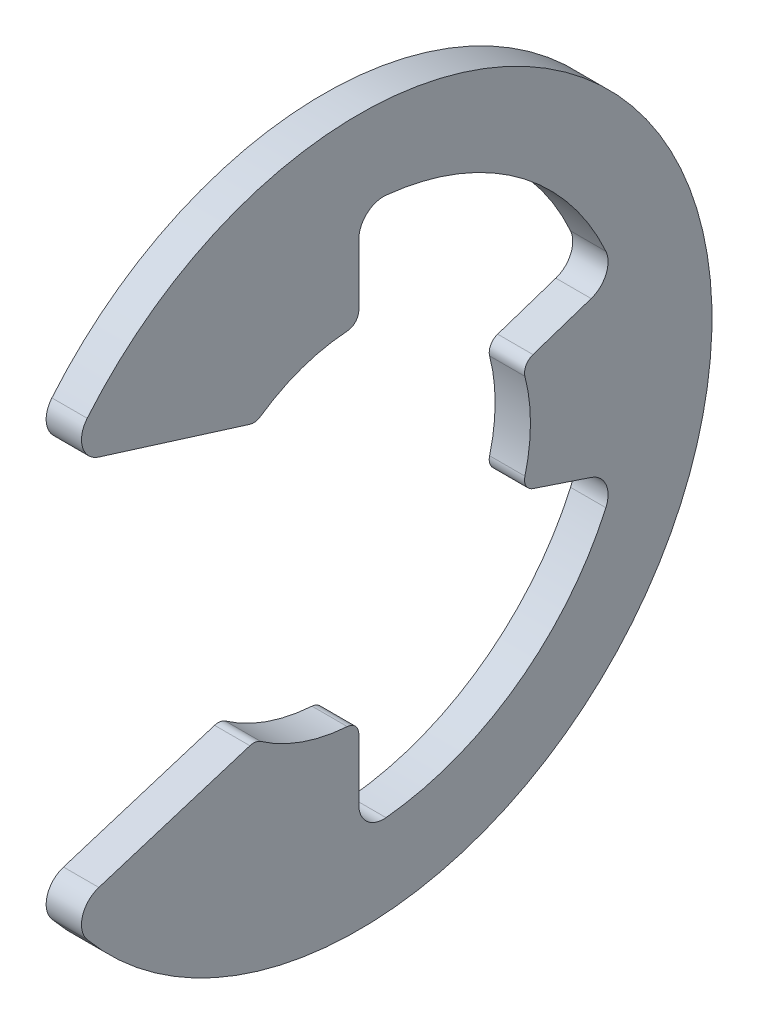
ISO-10303-21;
HEADER;
FILE_DESCRIPTION(('STEP AP214'),'2;1');
FILE_NAME('part.step','',(''),(''),'','','');
FILE_SCHEMA(('AUTOMOTIVE_DESIGN { 1 0 10303 214 1 1 1 1 }'));
ENDSEC;
DATA;
#1=APPLICATION_CONTEXT('core data for automotive mechanical design processes');
#2=APPLICATION_PROTOCOL_DEFINITION('international standard','automotive_design',2000,#1);
#3=PRODUCT_CONTEXT('',#1,'mechanical');
#4=PRODUCT('Part','Part','',(#3));
#5=PRODUCT_RELATED_PRODUCT_CATEGORY('part','',(#4));
#6=PRODUCT_DEFINITION_FORMATION('','',#4);
#7=PRODUCT_DEFINITION_CONTEXT('part definition',#1,'design');
#8=PRODUCT_DEFINITION('design','',#6,#7);
#9=PRODUCT_DEFINITION_SHAPE('','',#8);
#10=(LENGTH_UNIT() NAMED_UNIT(*) SI_UNIT(.MILLI.,.METRE.));
#11=(NAMED_UNIT(*) PLANE_ANGLE_UNIT() SI_UNIT($,.RADIAN.));
#12=(NAMED_UNIT(*) SI_UNIT($,.STERADIAN.) SOLID_ANGLE_UNIT());
#13=UNCERTAINTY_MEASURE_WITH_UNIT(LENGTH_MEASURE(1.E-05),#10,'distance_accuracy_value','');
#14=(GEOMETRIC_REPRESENTATION_CONTEXT(3) GLOBAL_UNCERTAINTY_ASSIGNED_CONTEXT((#13)) GLOBAL_UNIT_ASSIGNED_CONTEXT((#10,
#11,#12)) REPRESENTATION_CONTEXT('',''));
#15=CARTESIAN_POINT('',(0.,0.,0.));
#16=DIRECTION('',(0.,0.,1.));
#17=DIRECTION('',(1.,0.,0.));
#18=AXIS2_PLACEMENT_3D('',#15,#16,#17);
#19=CARTESIAN_POINT('',(0.3175,3.30087634727507,0.22225));
#20=DIRECTION('',(-1.,0.,0.));
#21=DIRECTION('',(0.,0.,1.));
#22=AXIS2_PLACEMENT_3D('',#19,#20,#21);
#23=CYLINDRICAL_SURFACE('',#22,0.22225);
#24=CARTESIAN_POINT('',(0.3175,3.30087634727507,0.22225));
#25=DIRECTION('',(1.,0.,0.));
#26=DIRECTION('',(0.,0.,-1.));
#27=AXIS2_PLACEMENT_3D('',#24,#25,#26);
#28=CIRCLE('',#27,0.22225);
#29=CARTESIAN_POINT('',(0.3175,3.07912841607617,0.207319577735126));
#30=VERTEX_POINT('',#29);
#31=CARTESIAN_POINT('',(0.3175,3.30087634727507,0.));
#32=VERTEX_POINT('',#31);
#33=EDGE_CURVE('E191',#30,#32,#28,.T.);
#34=ORIENTED_EDGE('',*,*,#33,.F.);
#35=DIRECTION('',(1.,0.,0.));
#36=VECTOR('',#35,1.);
#37=CARTESIAN_POINT('',(0.3175,3.07912841607617,0.207319577735126));
#38=LINE('',#37,#36);
#39=CARTESIAN_POINT('',(-0.3175,3.07912841607617,0.207319577735126));
#40=VERTEX_POINT('',#39);
#41=EDGE_CURVE('E277',#40,#30,#38,.T.);
#42=ORIENTED_EDGE('',*,*,#41,.F.);
#43=CARTESIAN_POINT('',(-0.3175,3.30087634727507,0.22225));
#44=DIRECTION('',(-1.,0.,0.));
#45=DIRECTION('',(0.,0.,-1.));
#46=AXIS2_PLACEMENT_3D('',#43,#44,#45);
#47=CIRCLE('',#46,0.22225);
#48=CARTESIAN_POINT('',(-0.3175,3.30087634727507,0.));
#49=VERTEX_POINT('',#48);
#50=EDGE_CURVE('E219',#49,#40,#47,.T.);
#51=ORIENTED_EDGE('',*,*,#50,.F.);
#52=DIRECTION('',(-1.,0.,0.));
#53=VECTOR('',#52,1.);
#54=CARTESIAN_POINT('',(0.3175,3.30087634727507,0.));
#55=LINE('',#54,#53);
#56=EDGE_CURVE('E284',#32,#49,#55,.T.);
#57=ORIENTED_EDGE('',*,*,#56,.F.);
#58=EDGE_LOOP('',(#34,#42,#51,#57));
#59=FACE_BOUND('',#58,.T.);
#60=ADVANCED_FACE('F16',(#59),#23,.T.);
#61=CARTESIAN_POINT('',(0.3175,2.71420663972902,1.8916294667167));
#62=DIRECTION('',(-1.,0.,0.));
#63=DIRECTION('',(0.,0.,1.));
#64=AXIS2_PLACEMENT_3D('',#61,#62,#63);
#65=CYLINDRICAL_SURFACE('',#64,0.22225);
#66=CARTESIAN_POINT('',(0.3175,2.71420663972902,1.8916294667167));
#67=DIRECTION('',(1.,0.,0.));
#68=DIRECTION('',(0.,0.,-1.));
#69=AXIS2_PLACEMENT_3D('',#66,#67,#68);
#70=CIRCLE('',#69,0.22225);
#71=CARTESIAN_POINT('',(0.3175,2.50206600572264,1.957897210781));
#72=VERTEX_POINT('',#71);
#73=CARTESIAN_POINT('',(0.3175,2.53187030116757,1.76455263114072));
#74=VERTEX_POINT('',#73);
#75=EDGE_CURVE('E205',#72,#74,#70,.T.);
#76=ORIENTED_EDGE('',*,*,#75,.F.);
#77=DIRECTION('',(1.,0.,0.));
#78=VECTOR('',#77,1.);
#79=CARTESIAN_POINT('',(0.3175,2.50206600572264,1.957897210781));
#80=LINE('',#79,#78);
#81=CARTESIAN_POINT('',(-0.3175,2.50206600572264,1.957897210781));
#82=VERTEX_POINT('',#81);
#83=EDGE_CURVE('E260',#82,#72,#80,.T.);
#84=ORIENTED_EDGE('',*,*,#83,.F.);
#85=CARTESIAN_POINT('',(-0.3175,2.71420663972902,1.8916294667167));
#86=DIRECTION('',(-1.,0.,0.));
#87=DIRECTION('',(0.,0.,-1.));
#88=AXIS2_PLACEMENT_3D('',#85,#86,#87);
#89=CIRCLE('',#88,0.22225);
#90=CARTESIAN_POINT('',(-0.3175,2.53187030116757,1.76455263114072));
#91=VERTEX_POINT('',#90);
#92=EDGE_CURVE('E25',#91,#82,#89,.T.);
#93=ORIENTED_EDGE('',*,*,#92,.F.);
#94=DIRECTION('',(-1.,0.,0.));
#95=VECTOR('',#94,1.);
#96=CARTESIAN_POINT('',(0.3175,2.53187030116757,1.76455263114072));
#97=LINE('',#96,#95);
#98=EDGE_CURVE('E270',#74,#91,#97,.T.);
#99=ORIENTED_EDGE('',*,*,#98,.F.);
#100=EDGE_LOOP('',(#76,#84,#93,#99));
#101=FACE_BOUND('',#100,.T.);
#102=ADVANCED_FACE('F1089',(#101),#65,.T.);
#103=CARTESIAN_POINT('',(0.3175,-2.71420663972902,1.8916294667167));
#104=DIRECTION('',(-1.,0.,0.));
#105=DIRECTION('',(0.,0.,1.));
#106=AXIS2_PLACEMENT_3D('',#103,#104,#105);
#107=CYLINDRICAL_SURFACE('',#106,0.22225);
#108=CARTESIAN_POINT('',(0.3175,-2.71420663972902,1.8916294667167));
#109=DIRECTION('',(1.,0.,0.));
#110=DIRECTION('',(0.,0.,-1.));
#111=AXIS2_PLACEMENT_3D('',#108,#109,#110);
#112=CIRCLE('',#111,0.22225);
#113=CARTESIAN_POINT('',(0.3175,-2.53187030116757,1.76455263114072));
#114=VERTEX_POINT('',#113);
#115=CARTESIAN_POINT('',(0.3175,-2.50206600572264,1.957897210781));
#116=VERTEX_POINT('',#115);
#117=EDGE_CURVE('E200',#114,#116,#112,.T.);
#118=ORIENTED_EDGE('',*,*,#117,.F.);
#119=DIRECTION('',(1.,0.,0.));
#120=VECTOR('',#119,1.);
#121=CARTESIAN_POINT('',(0.3175,-2.53187030116757,1.76455263114072));
#122=LINE('',#121,#120);
#123=CARTESIAN_POINT('',(-0.3175,-2.53187030116757,1.76455263114072));
#124=VERTEX_POINT('',#123);
#125=EDGE_CURVE('E438',#124,#114,#122,.T.);
#126=ORIENTED_EDGE('',*,*,#125,.F.);
#127=CARTESIAN_POINT('',(-0.3175,-2.71420663972902,1.8916294667167));
#128=DIRECTION('',(-1.,0.,0.));
#129=DIRECTION('',(0.,0.,-1.));
#130=AXIS2_PLACEMENT_3D('',#127,#128,#129);
#131=CIRCLE('',#130,0.22225);
#132=CARTESIAN_POINT('',(-0.3175,-2.50206600572264,1.957897210781));
#133=VERTEX_POINT('',#132);
#134=EDGE_CURVE('E11',#133,#124,#131,.T.);
#135=ORIENTED_EDGE('',*,*,#134,.F.);
#136=DIRECTION('',(-1.,0.,0.));
#137=VECTOR('',#136,1.);
#138=CARTESIAN_POINT('',(0.3175,-2.50206600572264,1.957897210781));
#139=LINE('',#138,#137);
#140=EDGE_CURVE('E447',#116,#133,#139,.T.);
#141=ORIENTED_EDGE('',*,*,#140,.F.);
#142=EDGE_LOOP('',(#118,#126,#135,#141));
#143=FACE_BOUND('',#142,.T.);
#144=ADVANCED_FACE('F1097',(#143),#107,.T.);
#145=CARTESIAN_POINT('',(0.3175,-3.30087634727507,0.22225));
#146=DIRECTION('',(-1.,0.,0.));
#147=DIRECTION('',(0.,0.,1.));
#148=AXIS2_PLACEMENT_3D('',#145,#146,#147);
#149=CYLINDRICAL_SURFACE('',#148,0.22225);
#150=CARTESIAN_POINT('',(0.3175,-3.30087634727507,0.22225));
#151=DIRECTION('',(1.,0.,0.));
#152=DIRECTION('',(0.,0.,-1.));
#153=AXIS2_PLACEMENT_3D('',#150,#151,#152);
#154=CIRCLE('',#153,0.22225);
#155=CARTESIAN_POINT('',(0.3175,-3.30087634727507,0.));
#156=VERTEX_POINT('',#155);
#157=CARTESIAN_POINT('',(0.3175,-3.07912841607617,0.207319577735124));
#158=VERTEX_POINT('',#157);
#159=EDGE_CURVE('E198',#156,#158,#154,.T.);
#160=ORIENTED_EDGE('',*,*,#159,.F.);
#161=DIRECTION('',(1.,0.,0.));
#162=VECTOR('',#161,1.);
#163=CARTESIAN_POINT('',(0.3175,-3.30087634727507,0.));
#164=LINE('',#163,#162);
#165=CARTESIAN_POINT('',(-0.3175,-3.30087634727507,0.));
#166=VERTEX_POINT('',#165);
#167=EDGE_CURVE('E400',#166,#156,#164,.T.);
#168=ORIENTED_EDGE('',*,*,#167,.F.);
#169=CARTESIAN_POINT('',(-0.3175,-3.30087634727507,0.22225));
#170=DIRECTION('',(-1.,0.,0.));
#171=DIRECTION('',(0.,0.,-1.));
#172=AXIS2_PLACEMENT_3D('',#169,#170,#171);
#173=CIRCLE('',#172,0.22225);
#174=CARTESIAN_POINT('',(-0.3175,-3.07912841607617,0.207319577735124));
#175=VERTEX_POINT('',#174);
#176=EDGE_CURVE('E210',#175,#166,#173,.T.);
#177=ORIENTED_EDGE('',*,*,#176,.F.);
#178=DIRECTION('',(-1.,0.,0.));
#179=VECTOR('',#178,1.);
#180=CARTESIAN_POINT('',(0.3175,-3.07912841607617,0.207319577735125));
#181=LINE('',#180,#179);
#182=EDGE_CURVE('E398',#158,#175,#181,.T.);
#183=ORIENTED_EDGE('',*,*,#182,.F.);
#184=EDGE_LOOP('',(#160,#168,#177,#183));
#185=FACE_BOUND('',#184,.T.);
#186=ADVANCED_FACE('F395',(#185),#149,.T.);
#187=CARTESIAN_POINT('',(0.3175,4.40336689167331,-0.4445));
#188=DIRECTION('',(-1.,0.,0.));
#189=DIRECTION('',(0.,0.,1.));
#190=AXIS2_PLACEMENT_3D('',#187,#188,#189);
#191=CYLINDRICAL_SURFACE('',#190,0.4445);
#192=CARTESIAN_POINT('',(0.3175,4.40336689167331,-0.4445));
#193=DIRECTION('',(-1.,0.,0.));
#194=DIRECTION('',(0.,0.,-1.));
#195=AXIS2_PLACEMENT_3D('',#192,#193,#194);
#196=CIRCLE('',#195,0.4445);
#197=CARTESIAN_POINT('',(0.3175,4.40336689167331,0.));
#198=VERTEX_POINT('',#197);
#199=CARTESIAN_POINT('',(0.3175,4.84561932872465,-0.489143386096454));
#200=VERTEX_POINT('',#199);
#201=EDGE_CURVE('E195',#198,#200,#196,.T.);
#202=ORIENTED_EDGE('',*,*,#201,.F.);
#203=DIRECTION('',(1.,0.,0.));
#204=VECTOR('',#203,1.);
#205=CARTESIAN_POINT('',(0.3175,4.40336689167331,0.));
#206=LINE('',#205,#204);
#207=CARTESIAN_POINT('',(-0.3175,4.40336689167331,0.));
#208=VERTEX_POINT('',#207);
#209=EDGE_CURVE('E185',#208,#198,#206,.T.);
#210=ORIENTED_EDGE('',*,*,#209,.F.);
#211=CARTESIAN_POINT('',(-0.3175,4.40336689167331,-0.4445));
#212=DIRECTION('',(1.,0.,0.));
#213=DIRECTION('',(0.,0.,-1.));
#214=AXIS2_PLACEMENT_3D('',#211,#212,#213);
#215=CIRCLE('',#214,0.4445);
#216=CARTESIAN_POINT('',(-0.3175,4.84561932872465,-0.489143386096454));
#217=VERTEX_POINT('',#216);
#218=EDGE_CURVE('E220',#217,#208,#215,.T.);
#219=ORIENTED_EDGE('',*,*,#218,.F.);
#220=DIRECTION('',(-1.,0.,0.));
#221=VECTOR('',#220,1.);
#222=CARTESIAN_POINT('',(0.3175,4.84561932872465,-0.489143386096454));
#223=LINE('',#222,#221);
#224=EDGE_CURVE('E162',#200,#217,#223,.T.);
#225=ORIENTED_EDGE('',*,*,#224,.F.);
#226=EDGE_LOOP('',(#202,#210,#219,#225));
#227=FACE_BOUND('',#226,.T.);
#228=ADVANCED_FACE('F297',(#227),#191,.F.);
#229=CARTESIAN_POINT('',(0.3175,1.81415660108981,-4.03683738332459));
#230=DIRECTION('',(-1.,0.,0.));
#231=DIRECTION('',(0.,0.,1.));
#232=AXIS2_PLACEMENT_3D('',#229,#230,#231);
#233=CYLINDRICAL_SURFACE('',#232,0.4445);
#234=CARTESIAN_POINT('',(0.3175,1.81415660108981,-4.03683738332459));
#235=DIRECTION('',(-1.,0.,0.));
#236=DIRECTION('',(0.,0.,-1.));
#237=AXIS2_PLACEMENT_3D('',#234,#235,#236);
#238=CIRCLE('',#237,0.4445);
#239=CARTESIAN_POINT('',(0.3175,1.99636153603219,-4.44227740562462));
#240=VERTEX_POINT('',#239);
#241=CARTESIAN_POINT('',(0.3175,1.39246687510636,-4.17740062531908));
#242=VERTEX_POINT('',#241);
#243=EDGE_CURVE('E36',#240,#242,#238,.T.);
#244=ORIENTED_EDGE('',*,*,#243,.F.);
#245=DIRECTION('',(1.,0.,0.));
#246=VECTOR('',#245,1.);
#247=CARTESIAN_POINT('',(0.3175,1.99636153603219,-4.44227740562462));
#248=LINE('',#247,#246);
#249=CARTESIAN_POINT('',(-0.3175,1.99636153603219,-4.44227740562462));
#250=VERTEX_POINT('',#249);
#251=EDGE_CURVE('E178',#250,#240,#248,.T.);
#252=ORIENTED_EDGE('',*,*,#251,.F.);
#253=CARTESIAN_POINT('',(-0.3175,1.81415660108981,-4.03683738332459));
#254=DIRECTION('',(1.,0.,0.));
#255=DIRECTION('',(0.,0.,-1.));
#256=AXIS2_PLACEMENT_3D('',#253,#254,#255);
#257=CIRCLE('',#256,0.4445);
#258=CARTESIAN_POINT('',(-0.3175,1.39246687510636,-4.17740062531908));
#259=VERTEX_POINT('',#258);
#260=EDGE_CURVE('E216',#259,#250,#257,.T.);
#261=ORIENTED_EDGE('',*,*,#260,.F.);
#262=DIRECTION('',(-1.,0.,0.));
#263=VECTOR('',#262,1.);
#264=CARTESIAN_POINT('',(-0.3175,1.39246687510636,-4.17740062531908));
#265=LINE('',#264,#263);
#266=EDGE_CURVE('E161',#242,#259,#265,.T.);
#267=ORIENTED_EDGE('',*,*,#266,.F.);
#268=EDGE_LOOP('',(#244,#252,#261,#267));
#269=FACE_BOUND('',#268,.T.);
#270=ADVANCED_FACE('F291',(#269),#233,.F.);
#271=CARTESIAN_POINT('',(0.3175,-1.81415660108981,-4.03683738332459));
#272=DIRECTION('',(-1.,0.,0.));
#273=DIRECTION('',(0.,0.,1.));
#274=AXIS2_PLACEMENT_3D('',#271,#272,#273);
#275=CYLINDRICAL_SURFACE('',#274,0.4445);
#276=CARTESIAN_POINT('',(0.3175,-1.81415660108981,-4.03683738332459));
#277=DIRECTION('',(-1.,0.,0.));
#278=DIRECTION('',(0.,0.,-1.));
#279=AXIS2_PLACEMENT_3D('',#276,#277,#278);
#280=CIRCLE('',#279,0.4445);
#281=CARTESIAN_POINT('',(0.3175,-1.39246687510636,-4.17740062531908));
#282=VERTEX_POINT('',#281);
#283=CARTESIAN_POINT('',(0.3175,-1.99636153603219,-4.44227740562462));
#284=VERTEX_POINT('',#283);
#285=EDGE_CURVE('E181',#282,#284,#280,.T.);
#286=ORIENTED_EDGE('',*,*,#285,.F.);
#287=DIRECTION('',(1.,0.,0.));
#288=VECTOR('',#287,1.);
#289=CARTESIAN_POINT('',(0.3175,-1.39246687510636,-4.17740062531908));
#290=LINE('',#289,#288);
#291=CARTESIAN_POINT('',(-0.3175,-1.39246687510636,-4.17740062531908));
#292=VERTEX_POINT('',#291);
#293=EDGE_CURVE('E703',#292,#282,#290,.T.);
#294=ORIENTED_EDGE('',*,*,#293,.F.);
#295=CARTESIAN_POINT('',(-0.3175,-1.81415660108981,-4.03683738332459));
#296=DIRECTION('',(1.,0.,0.));
#297=DIRECTION('',(0.,0.,-1.));
#298=AXIS2_PLACEMENT_3D('',#295,#296,#297);
#299=CIRCLE('',#298,0.4445);
#300=CARTESIAN_POINT('',(-0.3175,-1.99636153603219,-4.44227740562462));
#301=VERTEX_POINT('',#300);
#302=EDGE_CURVE('E215',#301,#292,#299,.T.);
#303=ORIENTED_EDGE('',*,*,#302,.F.);
#304=DIRECTION('',(-1.,0.,0.));
#305=VECTOR('',#304,1.);
#306=CARTESIAN_POINT('',(0.3175,-1.99636153603219,-4.44227740562462));
#307=LINE('',#306,#305);
#308=EDGE_CURVE('E419',#284,#301,#307,.T.);
#309=ORIENTED_EDGE('',*,*,#308,.F.);
#310=EDGE_LOOP('',(#286,#294,#303,#309));
#311=FACE_BOUND('',#310,.T.);
#312=ADVANCED_FACE('F1118',(#311),#275,.F.);
#313=CARTESIAN_POINT('',(0.3175,-4.40336689167331,-0.4445));
#314=DIRECTION('',(-1.,0.,0.));
#315=DIRECTION('',(0.,0.,1.));
#316=AXIS2_PLACEMENT_3D('',#313,#314,#315);
#317=CYLINDRICAL_SURFACE('',#316,0.4445);
#318=CARTESIAN_POINT('',(0.3175,-4.40336689167331,-0.4445));
#319=DIRECTION('',(-1.,0.,0.));
#320=DIRECTION('',(0.,0.,-1.));
#321=AXIS2_PLACEMENT_3D('',#318,#319,#320);
#322=CIRCLE('',#321,0.4445);
#323=CARTESIAN_POINT('',(0.3175,-4.84561932872465,-0.489143386096454));
#324=VERTEX_POINT('',#323);
#325=CARTESIAN_POINT('',(0.3175,-4.40336689167331,0.));
#326=VERTEX_POINT('',#325);
#327=EDGE_CURVE('E186',#324,#326,#322,.T.);
#328=ORIENTED_EDGE('',*,*,#327,.F.);
#329=DIRECTION('',(1.,0.,0.));
#330=VECTOR('',#329,1.);
#331=CARTESIAN_POINT('',(0.3175,-4.84561932872465,-0.489143386096454));
#332=LINE('',#331,#330);
#333=CARTESIAN_POINT('',(-0.3175,-4.84561932872465,-0.489143386096454));
#334=VERTEX_POINT('',#333);
#335=EDGE_CURVE('E686',#334,#324,#332,.T.);
#336=ORIENTED_EDGE('',*,*,#335,.F.);
#337=CARTESIAN_POINT('',(-0.3175,-4.40336689167331,-0.4445));
#338=DIRECTION('',(1.,0.,0.));
#339=DIRECTION('',(0.,0.,-1.));
#340=AXIS2_PLACEMENT_3D('',#337,#338,#339);
#341=CIRCLE('',#340,0.4445);
#342=CARTESIAN_POINT('',(-0.3175,-4.40336689167331,0.));
#343=VERTEX_POINT('',#342);
#344=EDGE_CURVE('E208',#343,#334,#341,.T.);
#345=ORIENTED_EDGE('',*,*,#344,.F.);
#346=DIRECTION('',(-1.,0.,0.));
#347=VECTOR('',#346,1.);
#348=CARTESIAN_POINT('',(-0.3175,-4.40336689167331,0.));
#349=LINE('',#348,#347);
#350=EDGE_CURVE('E412',#326,#343,#349,.T.);
#351=ORIENTED_EDGE('',*,*,#350,.F.);
#352=EDGE_LOOP('',(#328,#336,#345,#351));
#353=FACE_BOUND('',#352,.T.);
#354=ADVANCED_FACE('F1125',(#353),#317,.F.);
#355=CARTESIAN_POINT('',(-0.3175,0.,0.));
#356=DIRECTION('',(1.,0.,0.));
#357=DIRECTION('',(0.,1.,0.));
#358=AXIS2_PLACEMENT_3D('',#355,#356,#357);
#359=PLANE('',#358);
#360=CARTESIAN_POINT('',(-0.3175,0.,0.));
#361=DIRECTION('',(-1.,0.,0.));
#362=DIRECTION('',(0.,0.,-1.));
#363=AXIS2_PLACEMENT_3D('',#360,#361,#362);
#364=CIRCLE('',#363,3.0861);
#365=EDGE_CURVE('E434',#175,#124,#364,.T.);
#366=ORIENTED_EDGE('',*,*,#365,.F.);
#367=ORIENTED_EDGE('',*,*,#176,.T.);
#368=DIRECTION('',(0.,1.,0.));
#369=VECTOR('',#368,1.);
#370=CARTESIAN_POINT('',(-0.3175,-4.87024516129032,0.));
#371=LINE('',#370,#369);
#372=EDGE_CURVE('E411',#343,#166,#371,.T.);
#373=ORIENTED_EDGE('',*,*,#372,.F.);
#374=ORIENTED_EDGE('',*,*,#344,.T.);
#375=CARTESIAN_POINT('',(-0.3175,0.,0.));
#376=DIRECTION('',(-1.,0.,0.));
#377=DIRECTION('',(0.,0.,-1.));
#378=AXIS2_PLACEMENT_3D('',#375,#376,#377);
#379=CIRCLE('',#378,4.87024516129032);
#380=EDGE_CURVE('E695',#301,#334,#379,.T.);
#381=ORIENTED_EDGE('',*,*,#380,.F.);
#382=ORIENTED_EDGE('',*,*,#302,.T.);
#383=DIRECTION('',(0.,-0.316227766016838,-0.948683298050514));
#384=VECTOR('',#383,1.);
#385=CARTESIAN_POINT('',(-0.3175,-0.975910508704563,-2.92773152611369));
#386=LINE('',#385,#384);
#387=CARTESIAN_POINT('',(-0.3175,-1.04382875319661,-3.13148625958984));
#388=VERTEX_POINT('',#387);
#389=EDGE_CURVE('E711',#388,#292,#386,.T.);
#390=ORIENTED_EDGE('',*,*,#389,.F.);
#391=CARTESIAN_POINT('',(-0.3175,-0.832983890204888,-3.20176788058708));
#392=DIRECTION('',(-1.,0.,0.));
#393=DIRECTION('',(0.,0.,-1.));
#394=AXIS2_PLACEMENT_3D('',#391,#392,#393);
#395=CIRCLE('',#394,0.22225);
#396=CARTESIAN_POINT('',(-0.3175,-0.777025279538533,-2.98667790780293));
#397=VERTEX_POINT('',#396);
#398=EDGE_CURVE('E824',#388,#397,#395,.T.);
#399=ORIENTED_EDGE('',*,*,#398,.T.);
#400=CARTESIAN_POINT('',(-0.3175,0.,0.));
#401=DIRECTION('',(-1.,0.,0.));
#402=DIRECTION('',(0.,0.,-1.));
#403=AXIS2_PLACEMENT_3D('',#400,#401,#402);
#404=CIRCLE('',#403,3.0861);
#405=CARTESIAN_POINT('',(-0.3175,0.777025279538533,-2.98667790780293));
#406=VERTEX_POINT('',#405);
#407=EDGE_CURVE('E142',#406,#397,#404,.T.);
#408=ORIENTED_EDGE('',*,*,#407,.F.);
#409=CARTESIAN_POINT('',(-0.3175,0.832983890204889,-3.20176788058709));
#410=DIRECTION('',(-1.,0.,0.));
#411=DIRECTION('',(0.,0.,-1.));
#412=AXIS2_PLACEMENT_3D('',#409,#410,#411);
#413=CIRCLE('',#412,0.22225);
#414=CARTESIAN_POINT('',(-0.3175,1.04382875319662,-3.13148625958984));
#415=VERTEX_POINT('',#414);
#416=EDGE_CURVE('E135',#406,#415,#413,.T.);
#417=ORIENTED_EDGE('',*,*,#416,.T.);
#418=DIRECTION('',(0.,-0.316227766016838,0.948683298050514));
#419=VECTOR('',#418,1.);
#420=CARTESIAN_POINT('',(-0.3175,1.54010674730915,-4.62032024192746));
#421=LINE('',#420,#419);
#422=EDGE_CURVE('E139',#259,#415,#421,.T.);
#423=ORIENTED_EDGE('',*,*,#422,.F.);
#424=ORIENTED_EDGE('',*,*,#260,.T.);
#425=CARTESIAN_POINT('',(-0.3175,0.,0.));
#426=DIRECTION('',(-1.,0.,0.));
#427=DIRECTION('',(0.,0.,-1.));
#428=AXIS2_PLACEMENT_3D('',#425,#426,#427);
#429=CIRCLE('',#428,4.87024516129032);
#430=EDGE_CURVE('E177',#217,#250,#429,.T.);
#431=ORIENTED_EDGE('',*,*,#430,.F.);
#432=ORIENTED_EDGE('',*,*,#218,.T.);
#433=DIRECTION('',(0.,1.,0.));
#434=VECTOR('',#433,1.);
#435=CARTESIAN_POINT('',(-0.3175,3.0861,0.));
#436=LINE('',#435,#434);
#437=EDGE_CURVE('E173',#49,#208,#436,.T.);
#438=ORIENTED_EDGE('',*,*,#437,.F.);
#439=ORIENTED_EDGE('',*,*,#50,.T.);
#440=CARTESIAN_POINT('',(-0.3175,0.,0.));
#441=DIRECTION('',(-1.,0.,0.));
#442=DIRECTION('',(0.,0.,-1.));
#443=AXIS2_PLACEMENT_3D('',#440,#441,#442);
#444=CIRCLE('',#443,3.0861);
#445=EDGE_CURVE('E275',#91,#40,#444,.T.);
#446=ORIENTED_EDGE('',*,*,#445,.F.);
#447=ORIENTED_EDGE('',*,*,#92,.T.);
#448=DIRECTION('',(0.,-0.29816757734219,-0.954513538836349));
#449=VECTOR('',#448,1.);
#450=CARTESIAN_POINT('',(-0.3175,3.53770382148176,5.27324868287788));
#451=LINE('',#450,#449);
#452=CARTESIAN_POINT('',(-0.3175,3.35053887647162,4.67408402654532));
#453=VERTEX_POINT('',#452);
#454=EDGE_CURVE('E251',#453,#82,#451,.T.);
#455=ORIENTED_EDGE('',*,*,#454,.F.);
#456=CARTESIAN_POINT('',(-0.3175,3.77482014448437,4.54154853841671));
#457=DIRECTION('',(-1.,0.,0.));
#458=DIRECTION('',(0.,0.,-1.));
#459=AXIS2_PLACEMENT_3D('',#456,#457,#458);
#460=CIRCLE('',#459,0.4445);
#461=CARTESIAN_POINT('',(-0.3175,4.05894639191868,4.88338552517926));
#462=VERTEX_POINT('',#461);
#463=EDGE_CURVE('E783',#453,#462,#460,.T.);
#464=ORIENTED_EDGE('',*,*,#463,.T.);
#465=CARTESIAN_POINT('',(-0.3175,0.,0.));
#466=DIRECTION('',(1.,0.,0.));
#467=DIRECTION('',(0.,0.,-1.));
#468=AXIS2_PLACEMENT_3D('',#465,#466,#467);
#469=CIRCLE('',#468,6.35);
#470=CARTESIAN_POINT('',(-0.3175,-4.05894639191868,4.88338552517926));
#471=VERTEX_POINT('',#470);
#472=EDGE_CURVE('E249',#471,#462,#469,.T.);
#473=ORIENTED_EDGE('',*,*,#472,.F.);
#474=CARTESIAN_POINT('',(-0.3175,-3.77482014448437,4.54154853841671));
#475=DIRECTION('',(-1.,0.,0.));
#476=DIRECTION('',(0.,0.,-1.));
#477=AXIS2_PLACEMENT_3D('',#474,#475,#476);
#478=CIRCLE('',#477,0.4445);
#479=CARTESIAN_POINT('',(-0.3175,-3.35053887647162,4.67408402654531));
#480=VERTEX_POINT('',#479);
#481=EDGE_CURVE('E754',#471,#480,#478,.T.);
#482=ORIENTED_EDGE('',*,*,#481,.T.);
#483=DIRECTION('',(0.,-0.29816757734219,0.954513538836348));
#484=VECTOR('',#483,1.);
#485=CARTESIAN_POINT('',(-0.3175,-2.46888,1.85166));
#486=LINE('',#485,#484);
#487=EDGE_CURVE('E238',#133,#480,#486,.T.);
#488=ORIENTED_EDGE('',*,*,#487,.F.);
#489=ORIENTED_EDGE('',*,*,#134,.T.);
#490=EDGE_LOOP('',(#366,#367,#373,#374,#381,#382,#390,#399,#408,#417,#423,#424,#431,#432,#438,
#439,#446,#447,#455,#464,#473,#482,#488,#489));
#491=FACE_BOUND('',#490,.T.);
#492=ADVANCED_FACE('F134',(#491),#359,.F.);
#493=CARTESIAN_POINT('',(0.3175,0.,0.));
#494=DIRECTION('',(1.,0.,0.));
#495=DIRECTION('',(0.,1.,0.));
#496=AXIS2_PLACEMENT_3D('',#493,#494,#495);
#497=PLANE('',#496);
#498=DIRECTION('',(0.,1.,0.));
#499=VECTOR('',#498,1.);
#500=CARTESIAN_POINT('',(0.3175,-4.87024516129032,0.));
#501=LINE('',#500,#499);
#502=EDGE_CURVE('E402',#326,#156,#501,.T.);
#503=ORIENTED_EDGE('',*,*,#502,.T.);
#504=ORIENTED_EDGE('',*,*,#159,.T.);
#505=CARTESIAN_POINT('',(0.3175,0.,0.));
#506=DIRECTION('',(-1.,0.,0.));
#507=DIRECTION('',(0.,0.,-1.));
#508=AXIS2_PLACEMENT_3D('',#505,#506,#507);
#509=CIRCLE('',#508,3.0861);
#510=EDGE_CURVE('E429',#158,#114,#509,.T.);
#511=ORIENTED_EDGE('',*,*,#510,.T.);
#512=ORIENTED_EDGE('',*,*,#117,.T.);
#513=DIRECTION('',(0.,-0.29816757734219,0.954513538836348));
#514=VECTOR('',#513,1.);
#515=CARTESIAN_POINT('',(0.3175,-2.46888,1.85166));
#516=LINE('',#515,#514);
#517=CARTESIAN_POINT('',(0.3175,-3.35053887647162,4.67408402654531));
#518=VERTEX_POINT('',#517);
#519=EDGE_CURVE('E444',#116,#518,#516,.T.);
#520=ORIENTED_EDGE('',*,*,#519,.T.);
#521=CARTESIAN_POINT('',(0.3175,-3.77482014448437,4.54154853841671));
#522=DIRECTION('',(1.,0.,0.));
#523=DIRECTION('',(0.,0.,-1.));
#524=AXIS2_PLACEMENT_3D('',#521,#522,#523);
#525=CIRCLE('',#524,0.4445);
#526=CARTESIAN_POINT('',(0.3175,-4.05894639191868,4.88338552517926));
#527=VERTEX_POINT('',#526);
#528=EDGE_CURVE('E757',#518,#527,#525,.T.);
#529=ORIENTED_EDGE('',*,*,#528,.T.);
#530=CARTESIAN_POINT('',(0.3175,0.,0.));
#531=DIRECTION('',(1.,0.,0.));
#532=DIRECTION('',(0.,0.,-1.));
#533=AXIS2_PLACEMENT_3D('',#530,#531,#532);
#534=CIRCLE('',#533,6.35);
#535=CARTESIAN_POINT('',(0.3175,4.05894639191868,4.88338552517926));
#536=VERTEX_POINT('',#535);
#537=EDGE_CURVE('E243',#527,#536,#534,.T.);
#538=ORIENTED_EDGE('',*,*,#537,.T.);
#539=CARTESIAN_POINT('',(0.3175,3.77482014448437,4.54154853841671));
#540=DIRECTION('',(1.,0.,0.));
#541=DIRECTION('',(0.,0.,-1.));
#542=AXIS2_PLACEMENT_3D('',#539,#540,#541);
#543=CIRCLE('',#542,0.4445);
#544=CARTESIAN_POINT('',(0.3175,3.35053887647162,4.67408402654532));
#545=VERTEX_POINT('',#544);
#546=EDGE_CURVE('E780',#536,#545,#543,.T.);
#547=ORIENTED_EDGE('',*,*,#546,.T.);
#548=DIRECTION('',(0.,-0.29816757734219,-0.954513538836349));
#549=VECTOR('',#548,1.);
#550=CARTESIAN_POINT('',(0.3175,3.53770382148176,5.27324868287788));
#551=LINE('',#550,#549);
#552=EDGE_CURVE('E268',#545,#72,#551,.T.);
#553=ORIENTED_EDGE('',*,*,#552,.T.);
#554=ORIENTED_EDGE('',*,*,#75,.T.);
#555=CARTESIAN_POINT('',(0.3175,0.,0.));
#556=DIRECTION('',(-1.,0.,0.));
#557=DIRECTION('',(0.,0.,-1.));
#558=AXIS2_PLACEMENT_3D('',#555,#556,#557);
#559=CIRCLE('',#558,3.0861);
#560=EDGE_CURVE('E263',#74,#30,#559,.T.);
#561=ORIENTED_EDGE('',*,*,#560,.T.);
#562=ORIENTED_EDGE('',*,*,#33,.T.);
#563=DIRECTION('',(0.,1.,0.));
#564=VECTOR('',#563,1.);
#565=CARTESIAN_POINT('',(0.3175,3.0861,0.));
#566=LINE('',#565,#564);
#567=EDGE_CURVE('E278',#32,#198,#566,.T.);
#568=ORIENTED_EDGE('',*,*,#567,.T.);
#569=ORIENTED_EDGE('',*,*,#201,.T.);
#570=CARTESIAN_POINT('',(0.3175,0.,0.));
#571=DIRECTION('',(-1.,0.,0.));
#572=DIRECTION('',(0.,0.,-1.));
#573=AXIS2_PLACEMENT_3D('',#570,#571,#572);
#574=CIRCLE('',#573,4.87024516129032);
#575=EDGE_CURVE('E168',#200,#240,#574,.T.);
#576=ORIENTED_EDGE('',*,*,#575,.T.);
#577=ORIENTED_EDGE('',*,*,#243,.T.);
#578=DIRECTION('',(0.,-0.316227766016838,0.948683298050514));
#579=VECTOR('',#578,1.);
#580=CARTESIAN_POINT('',(0.3175,1.54010674730915,-4.62032024192746));
#581=LINE('',#580,#579);
#582=CARTESIAN_POINT('',(0.3175,1.04382875319662,-3.13148625958984));
#583=VERTEX_POINT('',#582);
#584=EDGE_CURVE('E160',#242,#583,#581,.T.);
#585=ORIENTED_EDGE('',*,*,#584,.T.);
#586=CARTESIAN_POINT('',(0.3175,0.832983890204889,-3.20176788058709));
#587=DIRECTION('',(1.,0.,0.));
#588=DIRECTION('',(0.,0.,-1.));
#589=AXIS2_PLACEMENT_3D('',#586,#587,#588);
#590=CIRCLE('',#589,0.22225);
#591=CARTESIAN_POINT('',(0.3175,0.777025279538533,-2.98667790780293));
#592=VERTEX_POINT('',#591);
#593=EDGE_CURVE('E146',#583,#592,#590,.T.);
#594=ORIENTED_EDGE('',*,*,#593,.T.);
#595=CARTESIAN_POINT('',(0.3175,0.,0.));
#596=DIRECTION('',(-1.,0.,0.));
#597=DIRECTION('',(0.,0.,-1.));
#598=AXIS2_PLACEMENT_3D('',#595,#596,#597);
#599=CIRCLE('',#598,3.0861);
#600=CARTESIAN_POINT('',(0.3175,-0.777025279538533,-2.98667790780293));
#601=VERTEX_POINT('',#600);
#602=EDGE_CURVE('E739',#592,#601,#599,.T.);
#603=ORIENTED_EDGE('',*,*,#602,.T.);
#604=CARTESIAN_POINT('',(0.3175,-0.832983890204888,-3.20176788058708));
#605=DIRECTION('',(1.,0.,0.));
#606=DIRECTION('',(0.,0.,-1.));
#607=AXIS2_PLACEMENT_3D('',#604,#605,#606);
#608=CIRCLE('',#607,0.22225);
#609=CARTESIAN_POINT('',(0.3175,-1.04382875319661,-3.13148625958984));
#610=VERTEX_POINT('',#609);
#611=EDGE_CURVE('E828',#601,#610,#608,.T.);
#612=ORIENTED_EDGE('',*,*,#611,.T.);
#613=DIRECTION('',(0.,-0.316227766016838,-0.948683298050514));
#614=VECTOR('',#613,1.);
#615=CARTESIAN_POINT('',(0.3175,-0.975910508704563,-2.92773152611369));
#616=LINE('',#615,#614);
#617=EDGE_CURVE('E720',#610,#282,#616,.T.);
#618=ORIENTED_EDGE('',*,*,#617,.T.);
#619=ORIENTED_EDGE('',*,*,#285,.T.);
#620=CARTESIAN_POINT('',(0.3175,0.,0.));
#621=DIRECTION('',(-1.,0.,0.));
#622=DIRECTION('',(0.,0.,-1.));
#623=AXIS2_PLACEMENT_3D('',#620,#621,#622);
#624=CIRCLE('',#623,4.87024516129032);
#625=EDGE_CURVE('E682',#284,#324,#624,.T.);
#626=ORIENTED_EDGE('',*,*,#625,.T.);
#627=ORIENTED_EDGE('',*,*,#327,.T.);
#628=EDGE_LOOP('',(#503,#504,#511,#512,#520,#529,#538,#547,#553,#554,#561,#562,#568,#569,#576,
#577,#585,#594,#603,#612,#618,#619,#626,#627));
#629=FACE_BOUND('',#628,.T.);
#630=ADVANCED_FACE('F404',(#629),#497,.T.);
#631=CARTESIAN_POINT('',(0.3175,1.54010674730915,-4.62032024192746));
#632=DIRECTION('',(0.,-0.948683298050514,-0.316227766016838));
#633=DIRECTION('',(0.,0.316227766016838,-0.948683298050514));
#634=AXIS2_PLACEMENT_3D('',#631,#632,#633);
#635=PLANE('',#634);
#636=ORIENTED_EDGE('',*,*,#422,.T.);
#637=DIRECTION('',(1.,0.,0.));
#638=VECTOR('',#637,1.);
#639=CARTESIAN_POINT('',(0.3175,1.04382875319662,-3.13148625958984));
#640=LINE('',#639,#638);
#641=EDGE_CURVE('E151',#415,#583,#640,.T.);
#642=ORIENTED_EDGE('',*,*,#641,.T.);
#643=ORIENTED_EDGE('',*,*,#584,.F.);
#644=ORIENTED_EDGE('',*,*,#266,.T.);
#645=EDGE_LOOP('',(#636,#642,#643,#644));
#646=FACE_BOUND('',#645,.T.);
#647=ADVANCED_FACE('F159',(#646),#635,.F.);
#648=CARTESIAN_POINT('',(0.3175,0.,0.));
#649=DIRECTION('',(-1.,0.,0.));
#650=DIRECTION('',(0.,0.,1.));
#651=AXIS2_PLACEMENT_3D('',#648,#649,#650);
#652=CYLINDRICAL_SURFACE('',#651,4.87024516129032);
#653=ORIENTED_EDGE('',*,*,#430,.T.);
#654=ORIENTED_EDGE('',*,*,#251,.T.);
#655=ORIENTED_EDGE('',*,*,#575,.F.);
#656=ORIENTED_EDGE('',*,*,#224,.T.);
#657=EDGE_LOOP('',(#653,#654,#655,#656));
#658=FACE_BOUND('',#657,.T.);
#659=ADVANCED_FACE('F294',(#658),#652,.F.);
#660=CARTESIAN_POINT('',(0.3175,3.0861,0.));
#661=DIRECTION('',(0.,0.,1.));
#662=DIRECTION('',(0.,-1.,0.));
#663=AXIS2_PLACEMENT_3D('',#660,#661,#662);
#664=PLANE('',#663);
#665=ORIENTED_EDGE('',*,*,#567,.F.);
#666=ORIENTED_EDGE('',*,*,#56,.T.);
#667=ORIENTED_EDGE('',*,*,#437,.T.);
#668=ORIENTED_EDGE('',*,*,#209,.T.);
#669=EDGE_LOOP('',(#665,#666,#667,#668));
#670=FACE_BOUND('',#669,.T.);
#671=ADVANCED_FACE('F1190',(#670),#664,.F.);
#672=CARTESIAN_POINT('',(0.3175,0.,0.));
#673=DIRECTION('',(-1.,0.,0.));
#674=DIRECTION('',(0.,0.,1.));
#675=AXIS2_PLACEMENT_3D('',#672,#673,#674);
#676=CYLINDRICAL_SURFACE('',#675,3.0861);
#677=ORIENTED_EDGE('',*,*,#560,.F.);
#678=ORIENTED_EDGE('',*,*,#98,.T.);
#679=ORIENTED_EDGE('',*,*,#445,.T.);
#680=ORIENTED_EDGE('',*,*,#41,.T.);
#681=EDGE_LOOP('',(#677,#678,#679,#680));
#682=FACE_BOUND('',#681,.T.);
#683=ADVANCED_FACE('F1183',(#682),#676,.F.);
#684=CARTESIAN_POINT('',(0.3175,3.53770382148176,5.27324868287788));
#685=DIRECTION('',(0.,0.954513538836348,-0.29816757734219));
#686=DIRECTION('',(-1.,0.,0.));
#687=AXIS2_PLACEMENT_3D('',#684,#685,#686);
#688=PLANE('',#687);
#689=ORIENTED_EDGE('',*,*,#454,.T.);
#690=ORIENTED_EDGE('',*,*,#83,.T.);
#691=ORIENTED_EDGE('',*,*,#552,.F.);
#692=DIRECTION('',(-1.,0.,0.));
#693=VECTOR('',#692,1.);
#694=CARTESIAN_POINT('',(0.3175,3.35053887647162,4.67408402654532));
#695=LINE('',#694,#693);
#696=EDGE_CURVE('E762',#545,#453,#695,.T.);
#697=ORIENTED_EDGE('',*,*,#696,.T.);
#698=EDGE_LOOP('',(#689,#690,#691,#697));
#699=FACE_BOUND('',#698,.T.);
#700=ADVANCED_FACE('F1154',(#699),#688,.F.);
#701=CARTESIAN_POINT('',(0.3175,0.,0.));
#702=DIRECTION('',(-1.,0.,0.));
#703=DIRECTION('',(0.,0.,1.));
#704=AXIS2_PLACEMENT_3D('',#701,#702,#703);
#705=CYLINDRICAL_SURFACE('',#704,6.35);
#706=ORIENTED_EDGE('',*,*,#537,.F.);
#707=DIRECTION('',(-1.,0.,0.));
#708=VECTOR('',#707,1.);
#709=CARTESIAN_POINT('',(0.3175,-4.05894639191868,4.88338552517926));
#710=LINE('',#709,#708);
#711=EDGE_CURVE('E746',#527,#471,#710,.T.);
#712=ORIENTED_EDGE('',*,*,#711,.T.);
#713=ORIENTED_EDGE('',*,*,#472,.T.);
#714=DIRECTION('',(1.,0.,0.));
#715=VECTOR('',#714,1.);
#716=CARTESIAN_POINT('',(0.3175,4.05894639191868,4.88338552517926));
#717=LINE('',#716,#715);
#718=EDGE_CURVE('E252',#462,#536,#717,.T.);
#719=ORIENTED_EDGE('',*,*,#718,.T.);
#720=EDGE_LOOP('',(#706,#712,#713,#719));
#721=FACE_BOUND('',#720,.T.);
#722=ADVANCED_FACE('F1149',(#721),#705,.T.);
#723=CARTESIAN_POINT('',(0.3175,-2.46888,1.85166));
#724=DIRECTION('',(0.,-0.954513538836348,-0.29816757734219));
#725=DIRECTION('',(0.,0.29816757734219,-0.954513538836348));
#726=AXIS2_PLACEMENT_3D('',#723,#724,#725);
#727=PLANE('',#726);
#728=ORIENTED_EDGE('',*,*,#519,.F.);
#729=ORIENTED_EDGE('',*,*,#140,.T.);
#730=ORIENTED_EDGE('',*,*,#487,.T.);
#731=DIRECTION('',(1.,0.,0.));
#732=VECTOR('',#731,1.);
#733=CARTESIAN_POINT('',(0.3175,-3.35053887647162,4.67408402654531));
#734=LINE('',#733,#732);
#735=EDGE_CURVE('E239',#480,#518,#734,.T.);
#736=ORIENTED_EDGE('',*,*,#735,.T.);
#737=EDGE_LOOP('',(#728,#729,#730,#736));
#738=FACE_BOUND('',#737,.T.);
#739=ADVANCED_FACE('F1153',(#738),#727,.F.);
#740=CARTESIAN_POINT('',(0.3175,0.,0.));
#741=DIRECTION('',(-1.,0.,0.));
#742=DIRECTION('',(0.,0.,1.));
#743=AXIS2_PLACEMENT_3D('',#740,#741,#742);
#744=CYLINDRICAL_SURFACE('',#743,3.0861);
#745=ORIENTED_EDGE('',*,*,#510,.F.);
#746=ORIENTED_EDGE('',*,*,#182,.T.);
#747=ORIENTED_EDGE('',*,*,#365,.T.);
#748=ORIENTED_EDGE('',*,*,#125,.T.);
#749=EDGE_LOOP('',(#745,#746,#747,#748));
#750=FACE_BOUND('',#749,.T.);
#751=ADVANCED_FACE('F1163',(#750),#744,.F.);
#752=CARTESIAN_POINT('',(0.3175,-4.87024516129032,0.));
#753=DIRECTION('',(0.,0.,1.));
#754=DIRECTION('',(0.,-1.,0.));
#755=AXIS2_PLACEMENT_3D('',#752,#753,#754);
#756=PLANE('',#755);
#757=ORIENTED_EDGE('',*,*,#372,.T.);
#758=ORIENTED_EDGE('',*,*,#167,.T.);
#759=ORIENTED_EDGE('',*,*,#502,.F.);
#760=ORIENTED_EDGE('',*,*,#350,.T.);
#761=EDGE_LOOP('',(#757,#758,#759,#760));
#762=FACE_BOUND('',#761,.T.);
#763=ADVANCED_FACE('F414',(#762),#756,.F.);
#764=CARTESIAN_POINT('',(0.3175,0.,0.));
#765=DIRECTION('',(-1.,0.,0.));
#766=DIRECTION('',(0.,0.,1.));
#767=AXIS2_PLACEMENT_3D('',#764,#765,#766);
#768=CYLINDRICAL_SURFACE('',#767,4.87024516129032);
#769=ORIENTED_EDGE('',*,*,#380,.T.);
#770=ORIENTED_EDGE('',*,*,#335,.T.);
#771=ORIENTED_EDGE('',*,*,#625,.F.);
#772=ORIENTED_EDGE('',*,*,#308,.T.);
#773=EDGE_LOOP('',(#769,#770,#771,#772));
#774=FACE_BOUND('',#773,.T.);
#775=ADVANCED_FACE('F1198',(#774),#768,.F.);
#776=CARTESIAN_POINT('',(0.3175,-0.975910508704563,-2.92773152611369));
#777=DIRECTION('',(0.,0.948683298050514,-0.316227766016838));
#778=DIRECTION('',(-1.,0.,0.));
#779=AXIS2_PLACEMENT_3D('',#776,#777,#778);
#780=PLANE('',#779);
#781=ORIENTED_EDGE('',*,*,#617,.F.);
#782=DIRECTION('',(-1.,0.,0.));
#783=VECTOR('',#782,1.);
#784=CARTESIAN_POINT('',(0.3175,-1.04382875319661,-3.13148625958984));
#785=LINE('',#784,#783);
#786=EDGE_CURVE('E814',#610,#388,#785,.T.);
#787=ORIENTED_EDGE('',*,*,#786,.T.);
#788=ORIENTED_EDGE('',*,*,#389,.T.);
#789=ORIENTED_EDGE('',*,*,#293,.T.);
#790=EDGE_LOOP('',(#781,#787,#788,#789));
#791=FACE_BOUND('',#790,.T.);
#792=ADVANCED_FACE('F1206',(#791),#780,.F.);
#793=CARTESIAN_POINT('',(0.3175,0.,0.));
#794=DIRECTION('',(-1.,0.,0.));
#795=DIRECTION('',(0.,0.,1.));
#796=AXIS2_PLACEMENT_3D('',#793,#794,#795);
#797=CYLINDRICAL_SURFACE('',#796,3.0861);
#798=ORIENTED_EDGE('',*,*,#602,.F.);
#799=DIRECTION('',(-1.,0.,0.));
#800=VECTOR('',#799,1.);
#801=CARTESIAN_POINT('',(0.3175,0.777025279538533,-2.98667790780293));
#802=LINE('',#801,#800);
#803=EDGE_CURVE('E150',#592,#406,#802,.T.);
#804=ORIENTED_EDGE('',*,*,#803,.T.);
#805=ORIENTED_EDGE('',*,*,#407,.T.);
#806=DIRECTION('',(1.,0.,0.));
#807=VECTOR('',#806,1.);
#808=CARTESIAN_POINT('',(0.3175,-0.777025279538533,-2.98667790780293));
#809=LINE('',#808,#807);
#810=EDGE_CURVE('E727',#397,#601,#809,.T.);
#811=ORIENTED_EDGE('',*,*,#810,.T.);
#812=EDGE_LOOP('',(#798,#804,#805,#811));
#813=FACE_BOUND('',#812,.T.);
#814=ADVANCED_FACE('F925',(#813),#797,.F.);
#815=CARTESIAN_POINT('',(0.3175,-3.77482014448437,4.54154853841671));
#816=DIRECTION('',(-1.,0.,0.));
#817=DIRECTION('',(0.,0.,1.));
#818=AXIS2_PLACEMENT_3D('',#815,#816,#817);
#819=CYLINDRICAL_SURFACE('',#818,0.4445);
#820=ORIENTED_EDGE('',*,*,#528,.F.);
#821=ORIENTED_EDGE('',*,*,#735,.F.);
#822=ORIENTED_EDGE('',*,*,#481,.F.);
#823=ORIENTED_EDGE('',*,*,#711,.F.);
#824=EDGE_LOOP('',(#820,#821,#822,#823));
#825=FACE_BOUND('',#824,.T.);
#826=ADVANCED_FACE('F908',(#825),#819,.T.);
#827=CARTESIAN_POINT('',(0.3175,3.77482014448437,4.54154853841671));
#828=DIRECTION('',(-1.,0.,0.));
#829=DIRECTION('',(0.,0.,1.));
#830=AXIS2_PLACEMENT_3D('',#827,#828,#829);
#831=CYLINDRICAL_SURFACE('',#830,0.4445);
#832=ORIENTED_EDGE('',*,*,#546,.F.);
#833=ORIENTED_EDGE('',*,*,#718,.F.);
#834=ORIENTED_EDGE('',*,*,#463,.F.);
#835=ORIENTED_EDGE('',*,*,#696,.F.);
#836=EDGE_LOOP('',(#832,#833,#834,#835));
#837=FACE_BOUND('',#836,.T.);
#838=ADVANCED_FACE('F897',(#837),#831,.T.);
#839=CARTESIAN_POINT('',(0.3175,0.832983890204889,-3.20176788058709));
#840=DIRECTION('',(-1.,0.,0.));
#841=DIRECTION('',(0.,0.,1.));
#842=AXIS2_PLACEMENT_3D('',#839,#840,#841);
#843=CYLINDRICAL_SURFACE('',#842,0.22225);
#844=ORIENTED_EDGE('',*,*,#593,.F.);
#845=ORIENTED_EDGE('',*,*,#641,.F.);
#846=ORIENTED_EDGE('',*,*,#416,.F.);
#847=ORIENTED_EDGE('',*,*,#803,.F.);
#848=EDGE_LOOP('',(#844,#845,#846,#847));
#849=FACE_BOUND('',#848,.T.);
#850=ADVANCED_FACE('F155',(#849),#843,.T.);
#851=CARTESIAN_POINT('',(0.3175,-0.832983890204888,-3.20176788058708));
#852=DIRECTION('',(-1.,0.,0.));
#853=DIRECTION('',(0.,0.,1.));
#854=AXIS2_PLACEMENT_3D('',#851,#852,#853);
#855=CYLINDRICAL_SURFACE('',#854,0.22225);
#856=ORIENTED_EDGE('',*,*,#611,.F.);
#857=ORIENTED_EDGE('',*,*,#810,.F.);
#858=ORIENTED_EDGE('',*,*,#398,.F.);
#859=ORIENTED_EDGE('',*,*,#786,.F.);
#860=EDGE_LOOP('',(#856,#857,#858,#859));
#861=FACE_BOUND('',#860,.T.);
#862=ADVANCED_FACE('F882',(#861),#855,.T.);
#863=CLOSED_SHELL('',(#60,#102,#144,#186,#228,#270,#312,#354,#492,#630,#647,#659,#671,#683,#700,
#722,#739,#751,#763,#775,#792,#814,#826,#838,#850,#862));
#864=MANIFOLD_SOLID_BREP('B1',#863);
#865=ADVANCED_BREP_SHAPE_REPRESENTATION('',(#18,#864),#14);
#866=SHAPE_DEFINITION_REPRESENTATION(#9,#865);
ENDSEC;
END-ISO-10303-21;
